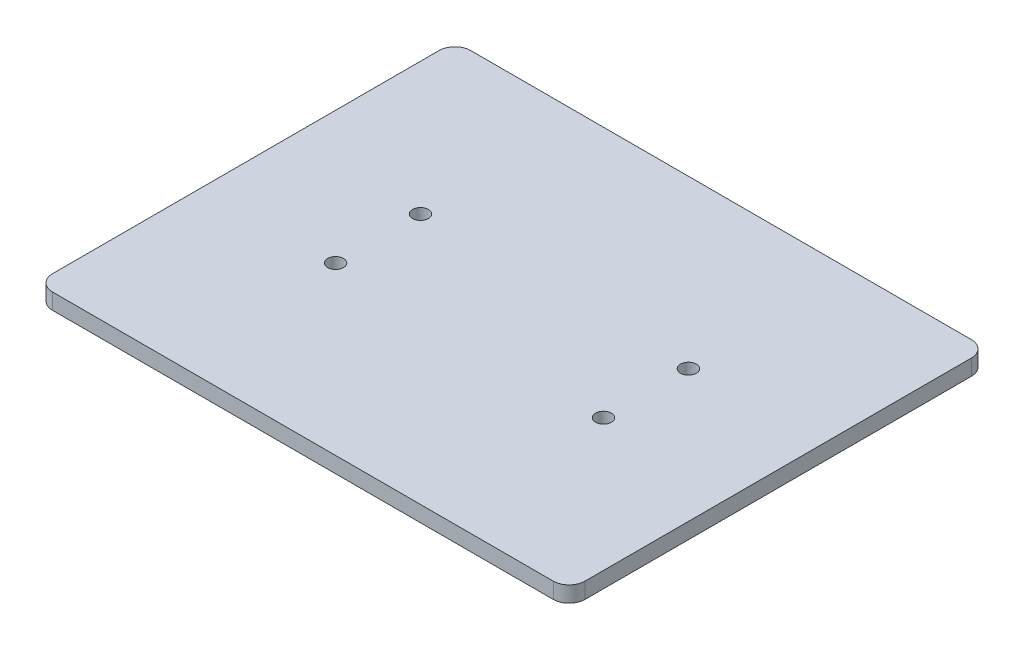
ISO-10303-21;
HEADER;
FILE_DESCRIPTION(('STEP AP214'),'2;1');
FILE_NAME('part.step','',(''),(''),'','','');
FILE_SCHEMA(('AUTOMOTIVE_DESIGN { 1 0 10303 214 1 1 1 1 }'));
ENDSEC;
DATA;
#1=APPLICATION_CONTEXT('core data for automotive mechanical design processes');
#2=APPLICATION_PROTOCOL_DEFINITION('international standard','automotive_design',2000,#1);
#3=PRODUCT_CONTEXT('',#1,'mechanical');
#4=PRODUCT('Part','Part','',(#3));
#5=PRODUCT_RELATED_PRODUCT_CATEGORY('part','',(#4));
#6=PRODUCT_DEFINITION_FORMATION('','',#4);
#7=PRODUCT_DEFINITION_CONTEXT('part definition',#1,'design');
#8=PRODUCT_DEFINITION('design','',#6,#7);
#9=PRODUCT_DEFINITION_SHAPE('','',#8);
#10=(LENGTH_UNIT() NAMED_UNIT(*) SI_UNIT(.MILLI.,.METRE.));
#11=(NAMED_UNIT(*) PLANE_ANGLE_UNIT() SI_UNIT($,.RADIAN.));
#12=(NAMED_UNIT(*) SI_UNIT($,.STERADIAN.) SOLID_ANGLE_UNIT());
#13=UNCERTAINTY_MEASURE_WITH_UNIT(LENGTH_MEASURE(1.E-05),#10,'distance_accuracy_value','');
#14=(GEOMETRIC_REPRESENTATION_CONTEXT(3) GLOBAL_UNCERTAINTY_ASSIGNED_CONTEXT((#13)) GLOBAL_UNIT_ASSIGNED_CONTEXT((#10,
#11,#12)) REPRESENTATION_CONTEXT('',''));
#15=CARTESIAN_POINT('',(0.,0.,0.));
#16=DIRECTION('',(0.,0.,1.));
#17=DIRECTION('',(1.,0.,0.));
#18=AXIS2_PLACEMENT_3D('',#15,#16,#17);
#19=CARTESIAN_POINT('',(0.,5.,0.));
#20=DIRECTION('',(0.,-1.,0.));
#21=DIRECTION('',(0.,0.,-1.));
#22=AXIS2_PLACEMENT_3D('',#19,#20,#21);
#23=PLANE('',#22);
#24=CARTESIAN_POINT('',(41.675,5.,-79.25));
#25=DIRECTION('',(0.,-1.,0.));
#26=DIRECTION('',(0.,0.,-1.));
#27=AXIS2_PLACEMENT_3D('',#24,#25,#26);
#28=CIRCLE('',#27,2.5);
#29=CARTESIAN_POINT('',(41.675,5.,-81.75));
#30=VERTEX_POINT('',#29);
#31=EDGE_CURVE('E162',#30,#30,#28,.T.);
#32=ORIENTED_EDGE('',*,*,#31,.T.);
#33=EDGE_LOOP('',(#32));
#34=FACE_BOUND('',#33,.T.);
#35=DIRECTION('',(1.,0.,0.));
#36=VECTOR('',#35,1.);
#37=CARTESIAN_POINT('',(0.,5.,0.));
#38=LINE('',#37,#36);
#39=CARTESIAN_POINT('',(5.,5.,0.));
#40=VERTEX_POINT('',#39);
#41=CARTESIAN_POINT('',(162.75,5.,0.));
#42=VERTEX_POINT('',#41);
#43=EDGE_CURVE('E185',#40,#42,#38,.T.);
#44=ORIENTED_EDGE('',*,*,#43,.T.);
#45=CARTESIAN_POINT('',(162.75,5.,-5.00000000000003));
#46=DIRECTION('',(0.,-1.,0.));
#47=DIRECTION('',(0.,0.,-1.));
#48=AXIS2_PLACEMENT_3D('',#45,#46,#47);
#49=CIRCLE('',#48,5.);
#50=CARTESIAN_POINT('',(167.75,5.,-5.00000000000003));
#51=VERTEX_POINT('',#50);
#52=EDGE_CURVE('E44',#42,#51,#49,.F.);
#53=ORIENTED_EDGE('',*,*,#52,.T.);
#54=DIRECTION('',(0.,0.,-1.));
#55=VECTOR('',#54,1.);
#56=CARTESIAN_POINT('',(167.75,5.,-131.75));
#57=LINE('',#56,#55);
#58=CARTESIAN_POINT('',(167.75,5.,-126.75));
#59=VERTEX_POINT('',#58);
#60=EDGE_CURVE('E128',#51,#59,#57,.T.);
#61=ORIENTED_EDGE('',*,*,#60,.T.);
#62=CARTESIAN_POINT('',(162.75,5.,-126.75));
#63=DIRECTION('',(0.,-1.,0.));
#64=DIRECTION('',(0.,0.,-1.));
#65=AXIS2_PLACEMENT_3D('',#62,#63,#64);
#66=CIRCLE('',#65,5.);
#67=CARTESIAN_POINT('',(162.75,5.,-131.75));
#68=VERTEX_POINT('',#67);
#69=EDGE_CURVE('E152',#59,#68,#66,.F.);
#70=ORIENTED_EDGE('',*,*,#69,.T.);
#71=DIRECTION('',(-1.,0.,0.));
#72=VECTOR('',#71,1.);
#73=CARTESIAN_POINT('',(0.,5.,-131.75));
#74=LINE('',#73,#72);
#75=CARTESIAN_POINT('',(5.,5.,-131.75));
#76=VERTEX_POINT('',#75);
#77=EDGE_CURVE('E125',#68,#76,#74,.T.);
#78=ORIENTED_EDGE('',*,*,#77,.T.);
#79=CARTESIAN_POINT('',(5.,5.,-126.75));
#80=DIRECTION('',(0.,-1.,0.));
#81=DIRECTION('',(0.,0.,-1.));
#82=AXIS2_PLACEMENT_3D('',#79,#80,#81);
#83=CIRCLE('',#82,5.);
#84=CARTESIAN_POINT('',(0.,5.,-126.75));
#85=VERTEX_POINT('',#84);
#86=EDGE_CURVE('E141',#76,#85,#83,.F.);
#87=ORIENTED_EDGE('',*,*,#86,.T.);
#88=DIRECTION('',(0.,0.,1.));
#89=VECTOR('',#88,1.);
#90=CARTESIAN_POINT('',(0.,5.,0.));
#91=LINE('',#90,#89);
#92=CARTESIAN_POINT('',(0.,5.,-5.));
#93=VERTEX_POINT('',#92);
#94=EDGE_CURVE('E183',#85,#93,#91,.T.);
#95=ORIENTED_EDGE('',*,*,#94,.T.);
#96=CARTESIAN_POINT('',(5.,5.,-5.));
#97=DIRECTION('',(0.,-1.,0.));
#98=DIRECTION('',(0.,0.,-1.));
#99=AXIS2_PLACEMENT_3D('',#96,#97,#98);
#100=CIRCLE('',#99,5.);
#101=EDGE_CURVE('E120',#93,#40,#100,.F.);
#102=ORIENTED_EDGE('',*,*,#101,.T.);
#103=EDGE_LOOP('',(#44,#53,#61,#70,#78,#87,#95,#102));
#104=FACE_BOUND('',#103,.T.);
#105=CARTESIAN_POINT('',(41.675,5.,-52.5));
#106=DIRECTION('',(0.,1.,0.));
#107=DIRECTION('',(0.,0.,1.));
#108=AXIS2_PLACEMENT_3D('',#105,#106,#107);
#109=CIRCLE('',#108,2.50000000000002);
#110=CARTESIAN_POINT('',(41.675,5.,-50.));
#111=VERTEX_POINT('',#110);
#112=EDGE_CURVE('E165',#111,#111,#109,.T.);
#113=ORIENTED_EDGE('',*,*,#112,.F.);
#114=EDGE_LOOP('',(#113));
#115=FACE_BOUND('',#114,.T.);
#116=CARTESIAN_POINT('',(126.075,5.,-79.25));
#117=DIRECTION('',(0.,1.,0.));
#118=DIRECTION('',(0.,0.,1.));
#119=AXIS2_PLACEMENT_3D('',#116,#117,#118);
#120=CIRCLE('',#119,2.5);
#121=CARTESIAN_POINT('',(126.075,5.,-76.75));
#122=VERTEX_POINT('',#121);
#123=EDGE_CURVE('E168',#122,#122,#120,.T.);
#124=ORIENTED_EDGE('',*,*,#123,.F.);
#125=EDGE_LOOP('',(#124));
#126=FACE_BOUND('',#125,.T.);
#127=CARTESIAN_POINT('',(126.075,5.,-52.5));
#128=DIRECTION('',(0.,-1.,0.));
#129=DIRECTION('',(0.,0.,-1.));
#130=AXIS2_PLACEMENT_3D('',#127,#128,#129);
#131=CIRCLE('',#130,2.50000000000002);
#132=CARTESIAN_POINT('',(126.075,5.,-55.));
#133=VERTEX_POINT('',#132);
#134=EDGE_CURVE('E178',#133,#133,#131,.T.);
#135=ORIENTED_EDGE('',*,*,#134,.T.);
#136=EDGE_LOOP('',(#135));
#137=FACE_BOUND('',#136,.T.);
#138=ADVANCED_FACE('F35',(#34,#104,#115,#126,#137),#23,.F.);
#139=CARTESIAN_POINT('',(0.,0.,0.));
#140=DIRECTION('',(0.,-1.,0.));
#141=DIRECTION('',(0.,0.,-1.));
#142=AXIS2_PLACEMENT_3D('',#139,#140,#141);
#143=PLANE('',#142);
#144=CARTESIAN_POINT('',(41.675,0.,-79.25));
#145=DIRECTION('',(0.,-1.,0.));
#146=DIRECTION('',(0.,0.,-1.));
#147=AXIS2_PLACEMENT_3D('',#144,#145,#146);
#148=CIRCLE('',#147,2.5);
#149=CARTESIAN_POINT('',(41.675,0.,-81.75));
#150=VERTEX_POINT('',#149);
#151=EDGE_CURVE('E111',#150,#150,#148,.F.);
#152=ORIENTED_EDGE('',*,*,#151,.T.);
#153=EDGE_LOOP('',(#152));
#154=FACE_BOUND('',#153,.T.);
#155=DIRECTION('',(0.,0.,-1.));
#156=VECTOR('',#155,1.);
#157=CARTESIAN_POINT('',(167.75,0.,-131.75));
#158=LINE('',#157,#156);
#159=CARTESIAN_POINT('',(167.75,0.,-5.00000000000003));
#160=VERTEX_POINT('',#159);
#161=CARTESIAN_POINT('',(167.75,0.,-126.75));
#162=VERTEX_POINT('',#161);
#163=EDGE_CURVE('E189',#160,#162,#158,.T.);
#164=ORIENTED_EDGE('',*,*,#163,.F.);
#165=CARTESIAN_POINT('',(162.75,0.,-5.00000000000003));
#166=DIRECTION('',(0.,-1.,0.));
#167=DIRECTION('',(0.,0.,-1.));
#168=AXIS2_PLACEMENT_3D('',#165,#166,#167);
#169=CIRCLE('',#168,5.);
#170=CARTESIAN_POINT('',(162.75,0.,0.));
#171=VERTEX_POINT('',#170);
#172=EDGE_CURVE('E11',#160,#171,#169,.T.);
#173=ORIENTED_EDGE('',*,*,#172,.T.);
#174=DIRECTION('',(1.,0.,0.));
#175=VECTOR('',#174,1.);
#176=CARTESIAN_POINT('',(0.,0.,0.));
#177=LINE('',#176,#175);
#178=CARTESIAN_POINT('',(5.,0.,0.));
#179=VERTEX_POINT('',#178);
#180=EDGE_CURVE('E110',#179,#171,#177,.T.);
#181=ORIENTED_EDGE('',*,*,#180,.F.);
#182=CARTESIAN_POINT('',(5.,0.,-5.));
#183=DIRECTION('',(0.,-1.,0.));
#184=DIRECTION('',(0.,0.,-1.));
#185=AXIS2_PLACEMENT_3D('',#182,#183,#184);
#186=CIRCLE('',#185,5.);
#187=CARTESIAN_POINT('',(0.,0.,-5.));
#188=VERTEX_POINT('',#187);
#189=EDGE_CURVE('E113',#179,#188,#186,.T.);
#190=ORIENTED_EDGE('',*,*,#189,.T.);
#191=DIRECTION('',(0.,0.,1.));
#192=VECTOR('',#191,1.);
#193=CARTESIAN_POINT('',(0.,0.,0.));
#194=LINE('',#193,#192);
#195=CARTESIAN_POINT('',(0.,0.,-126.75));
#196=VERTEX_POINT('',#195);
#197=EDGE_CURVE('E101',#196,#188,#194,.T.);
#198=ORIENTED_EDGE('',*,*,#197,.F.);
#199=CARTESIAN_POINT('',(5.,0.,-126.75));
#200=DIRECTION('',(0.,-1.,0.));
#201=DIRECTION('',(0.,0.,-1.));
#202=AXIS2_PLACEMENT_3D('',#199,#200,#201);
#203=CIRCLE('',#202,5.);
#204=CARTESIAN_POINT('',(5.,0.,-131.75));
#205=VERTEX_POINT('',#204);
#206=EDGE_CURVE('E139',#196,#205,#203,.T.);
#207=ORIENTED_EDGE('',*,*,#206,.T.);
#208=DIRECTION('',(-1.,0.,0.));
#209=VECTOR('',#208,1.);
#210=CARTESIAN_POINT('',(0.,0.,-131.75));
#211=LINE('',#210,#209);
#212=CARTESIAN_POINT('',(162.75,0.,-131.75));
#213=VERTEX_POINT('',#212);
#214=EDGE_CURVE('E131',#213,#205,#211,.T.);
#215=ORIENTED_EDGE('',*,*,#214,.F.);
#216=CARTESIAN_POINT('',(162.75,0.,-126.75));
#217=DIRECTION('',(0.,-1.,0.));
#218=DIRECTION('',(0.,0.,-1.));
#219=AXIS2_PLACEMENT_3D('',#216,#217,#218);
#220=CIRCLE('',#219,5.);
#221=EDGE_CURVE('E149',#213,#162,#220,.T.);
#222=ORIENTED_EDGE('',*,*,#221,.T.);
#223=EDGE_LOOP('',(#164,#173,#181,#190,#198,#207,#215,#222));
#224=FACE_BOUND('',#223,.T.);
#225=CARTESIAN_POINT('',(41.675,0.,-52.5));
#226=DIRECTION('',(0.,-1.,0.));
#227=DIRECTION('',(0.,0.,-1.));
#228=AXIS2_PLACEMENT_3D('',#225,#226,#227);
#229=CIRCLE('',#228,2.50000000000002);
#230=CARTESIAN_POINT('',(41.675,0.,-55.));
#231=VERTEX_POINT('',#230);
#232=EDGE_CURVE('E163',#231,#231,#229,.T.);
#233=ORIENTED_EDGE('',*,*,#232,.F.);
#234=EDGE_LOOP('',(#233));
#235=FACE_BOUND('',#234,.T.);
#236=CARTESIAN_POINT('',(126.075,0.,-79.25));
#237=DIRECTION('',(0.,-1.,0.));
#238=DIRECTION('',(0.,0.,-1.));
#239=AXIS2_PLACEMENT_3D('',#236,#237,#238);
#240=CIRCLE('',#239,2.5);
#241=CARTESIAN_POINT('',(126.075,0.,-81.75));
#242=VERTEX_POINT('',#241);
#243=EDGE_CURVE('E166',#242,#242,#240,.T.);
#244=ORIENTED_EDGE('',*,*,#243,.F.);
#245=EDGE_LOOP('',(#244));
#246=FACE_BOUND('',#245,.T.);
#247=CARTESIAN_POINT('',(126.075,0.,-52.5));
#248=DIRECTION('',(0.,-1.,0.));
#249=DIRECTION('',(0.,0.,-1.));
#250=AXIS2_PLACEMENT_3D('',#247,#248,#249);
#251=CIRCLE('',#250,2.50000000000002);
#252=CARTESIAN_POINT('',(126.075,0.,-55.));
#253=VERTEX_POINT('',#252);
#254=EDGE_CURVE('E39',#253,#253,#251,.F.);
#255=ORIENTED_EDGE('',*,*,#254,.T.);
#256=EDGE_LOOP('',(#255));
#257=FACE_BOUND('',#256,.T.);
#258=ADVANCED_FACE('F114',(#154,#224,#235,#246,#257),#143,.T.);
#259=CARTESIAN_POINT('',(162.75,5.,-5.00000000000003));
#260=DIRECTION('',(0.,-1.,0.));
#261=DIRECTION('',(0.,0.,-1.));
#262=AXIS2_PLACEMENT_3D('',#259,#260,#261);
#263=CYLINDRICAL_SURFACE('',#262,5.);
#264=DIRECTION('',(0.,-1.,0.));
#265=VECTOR('',#264,1.);
#266=CARTESIAN_POINT('',(167.75,5.,-5.00000000000003));
#267=LINE('',#266,#265);
#268=EDGE_CURVE('E154',#51,#160,#267,.T.);
#269=ORIENTED_EDGE('',*,*,#268,.F.);
#270=ORIENTED_EDGE('',*,*,#52,.F.);
#271=DIRECTION('',(0.,-1.,0.));
#272=VECTOR('',#271,1.);
#273=CARTESIAN_POINT('',(162.75,5.,0.));
#274=LINE('',#273,#272);
#275=EDGE_CURVE('E157',#171,#42,#274,.F.);
#276=ORIENTED_EDGE('',*,*,#275,.F.);
#277=ORIENTED_EDGE('',*,*,#172,.F.);
#278=EDGE_LOOP('',(#269,#270,#276,#277));
#279=FACE_BOUND('',#278,.T.);
#280=ADVANCED_FACE('F37',(#279),#263,.T.);
#281=CARTESIAN_POINT('',(162.75,5.,-126.75));
#282=DIRECTION('',(0.,1.,0.));
#283=DIRECTION('',(0.,0.,1.));
#284=AXIS2_PLACEMENT_3D('',#281,#282,#283);
#285=CYLINDRICAL_SURFACE('',#284,5.);
#286=DIRECTION('',(0.,1.,0.));
#287=VECTOR('',#286,1.);
#288=CARTESIAN_POINT('',(167.75,5.,-126.75));
#289=LINE('',#288,#287);
#290=EDGE_CURVE('E143',#162,#59,#289,.T.);
#291=ORIENTED_EDGE('',*,*,#290,.F.);
#292=ORIENTED_EDGE('',*,*,#221,.F.);
#293=DIRECTION('',(0.,1.,0.));
#294=VECTOR('',#293,1.);
#295=CARTESIAN_POINT('',(162.75,5.,-131.75));
#296=LINE('',#295,#294);
#297=EDGE_CURVE('E146',#68,#213,#296,.F.);
#298=ORIENTED_EDGE('',*,*,#297,.F.);
#299=ORIENTED_EDGE('',*,*,#69,.F.);
#300=EDGE_LOOP('',(#291,#292,#298,#299));
#301=FACE_BOUND('',#300,.T.);
#302=ADVANCED_FACE('F206',(#301),#285,.T.);
#303=CARTESIAN_POINT('',(5.,5.,-126.75));
#304=DIRECTION('',(0.,1.,0.));
#305=DIRECTION('',(0.,0.,1.));
#306=AXIS2_PLACEMENT_3D('',#303,#304,#305);
#307=CYLINDRICAL_SURFACE('',#306,5.);
#308=DIRECTION('',(0.,1.,0.));
#309=VECTOR('',#308,1.);
#310=CARTESIAN_POINT('',(5.,5.,-131.75));
#311=LINE('',#310,#309);
#312=EDGE_CURVE('E135',#205,#76,#311,.T.);
#313=ORIENTED_EDGE('',*,*,#312,.F.);
#314=ORIENTED_EDGE('',*,*,#206,.F.);
#315=DIRECTION('',(0.,1.,0.));
#316=VECTOR('',#315,1.);
#317=CARTESIAN_POINT('',(0.,5.,-126.75));
#318=LINE('',#317,#316);
#319=EDGE_CURVE('E108',#85,#196,#318,.F.);
#320=ORIENTED_EDGE('',*,*,#319,.F.);
#321=ORIENTED_EDGE('',*,*,#86,.F.);
#322=EDGE_LOOP('',(#313,#314,#320,#321));
#323=FACE_BOUND('',#322,.T.);
#324=ADVANCED_FACE('F199',(#323),#307,.T.);
#325=CARTESIAN_POINT('',(5.,5.,-5.));
#326=DIRECTION('',(0.,1.,0.));
#327=DIRECTION('',(0.,0.,1.));
#328=AXIS2_PLACEMENT_3D('',#325,#326,#327);
#329=CYLINDRICAL_SURFACE('',#328,5.);
#330=DIRECTION('',(0.,1.,0.));
#331=VECTOR('',#330,1.);
#332=CARTESIAN_POINT('',(0.,5.,-5.));
#333=LINE('',#332,#331);
#334=EDGE_CURVE('E106',#188,#93,#333,.T.);
#335=ORIENTED_EDGE('',*,*,#334,.F.);
#336=ORIENTED_EDGE('',*,*,#189,.F.);
#337=DIRECTION('',(0.,1.,0.));
#338=VECTOR('',#337,1.);
#339=CARTESIAN_POINT('',(5.,5.,0.));
#340=LINE('',#339,#338);
#341=EDGE_CURVE('E121',#40,#179,#340,.F.);
#342=ORIENTED_EDGE('',*,*,#341,.F.);
#343=ORIENTED_EDGE('',*,*,#101,.F.);
#344=EDGE_LOOP('',(#335,#336,#342,#343));
#345=FACE_BOUND('',#344,.T.);
#346=ADVANCED_FACE('F124',(#345),#329,.T.);
#347=CARTESIAN_POINT('',(0.,5.,0.));
#348=DIRECTION('',(1.,0.,0.));
#349=DIRECTION('',(0.,0.,-1.));
#350=AXIS2_PLACEMENT_3D('',#347,#348,#349);
#351=PLANE('',#350);
#352=ORIENTED_EDGE('',*,*,#94,.F.);
#353=ORIENTED_EDGE('',*,*,#319,.T.);
#354=ORIENTED_EDGE('',*,*,#197,.T.);
#355=ORIENTED_EDGE('',*,*,#334,.T.);
#356=EDGE_LOOP('',(#352,#353,#354,#355));
#357=FACE_BOUND('',#356,.T.);
#358=ADVANCED_FACE('F104',(#357),#351,.F.);
#359=CARTESIAN_POINT('',(0.,5.,0.));
#360=DIRECTION('',(0.,0.,-1.));
#361=DIRECTION('',(-1.,0.,0.));
#362=AXIS2_PLACEMENT_3D('',#359,#360,#361);
#363=PLANE('',#362);
#364=ORIENTED_EDGE('',*,*,#180,.T.);
#365=ORIENTED_EDGE('',*,*,#275,.T.);
#366=ORIENTED_EDGE('',*,*,#43,.F.);
#367=ORIENTED_EDGE('',*,*,#341,.T.);
#368=EDGE_LOOP('',(#364,#365,#366,#367));
#369=FACE_BOUND('',#368,.T.);
#370=ADVANCED_FACE('F210',(#369),#363,.F.);
#371=CARTESIAN_POINT('',(167.75,5.,-131.75));
#372=DIRECTION('',(-1.,0.,0.));
#373=DIRECTION('',(0.,0.,1.));
#374=AXIS2_PLACEMENT_3D('',#371,#372,#373);
#375=PLANE('',#374);
#376=ORIENTED_EDGE('',*,*,#60,.F.);
#377=ORIENTED_EDGE('',*,*,#268,.T.);
#378=ORIENTED_EDGE('',*,*,#163,.T.);
#379=ORIENTED_EDGE('',*,*,#290,.T.);
#380=EDGE_LOOP('',(#376,#377,#378,#379));
#381=FACE_BOUND('',#380,.T.);
#382=ADVANCED_FACE('F207',(#381),#375,.F.);
#383=CARTESIAN_POINT('',(0.,5.,-131.75));
#384=DIRECTION('',(0.,0.,1.));
#385=DIRECTION('',(1.,0.,0.));
#386=AXIS2_PLACEMENT_3D('',#383,#384,#385);
#387=PLANE('',#386);
#388=ORIENTED_EDGE('',*,*,#77,.F.);
#389=ORIENTED_EDGE('',*,*,#297,.T.);
#390=ORIENTED_EDGE('',*,*,#214,.T.);
#391=ORIENTED_EDGE('',*,*,#312,.T.);
#392=EDGE_LOOP('',(#388,#389,#390,#391));
#393=FACE_BOUND('',#392,.T.);
#394=ADVANCED_FACE('F194',(#393),#387,.F.);
#395=CARTESIAN_POINT('',(41.675,-5.,-79.25));
#396=DIRECTION('',(0.,1.,0.));
#397=DIRECTION('',(0.,0.,1.));
#398=AXIS2_PLACEMENT_3D('',#395,#396,#397);
#399=CYLINDRICAL_SURFACE('',#398,2.5);
#400=ORIENTED_EDGE('',*,*,#151,.F.);
#401=EDGE_LOOP('',(#400));
#402=FACE_BOUND('',#401,.T.);
#403=ORIENTED_EDGE('',*,*,#31,.F.);
#404=EDGE_LOOP('',(#403));
#405=FACE_BOUND('',#404,.T.);
#406=ADVANCED_FACE('F229',(#402,#405),#399,.F.);
#407=CARTESIAN_POINT('',(41.675,-5.,-52.5));
#408=DIRECTION('',(0.,1.,0.));
#409=DIRECTION('',(0.,0.,1.));
#410=AXIS2_PLACEMENT_3D('',#407,#408,#409);
#411=CYLINDRICAL_SURFACE('',#410,2.50000000000002);
#412=ORIENTED_EDGE('',*,*,#232,.T.);
#413=EDGE_LOOP('',(#412));
#414=FACE_BOUND('',#413,.T.);
#415=ORIENTED_EDGE('',*,*,#112,.T.);
#416=EDGE_LOOP('',(#415));
#417=FACE_BOUND('',#416,.T.);
#418=ADVANCED_FACE('F237',(#414,#417),#411,.F.);
#419=CARTESIAN_POINT('',(126.075,-5.,-79.25));
#420=DIRECTION('',(0.,1.,0.));
#421=DIRECTION('',(0.,0.,1.));
#422=AXIS2_PLACEMENT_3D('',#419,#420,#421);
#423=CYLINDRICAL_SURFACE('',#422,2.5);
#424=ORIENTED_EDGE('',*,*,#243,.T.);
#425=EDGE_LOOP('',(#424));
#426=FACE_BOUND('',#425,.T.);
#427=ORIENTED_EDGE('',*,*,#123,.T.);
#428=EDGE_LOOP('',(#427));
#429=FACE_BOUND('',#428,.T.);
#430=ADVANCED_FACE('F242',(#426,#429),#423,.F.);
#431=CARTESIAN_POINT('',(126.075,-5.,-52.5));
#432=DIRECTION('',(0.,1.,0.));
#433=DIRECTION('',(0.,0.,1.));
#434=AXIS2_PLACEMENT_3D('',#431,#432,#433);
#435=CYLINDRICAL_SURFACE('',#434,2.50000000000002);
#436=ORIENTED_EDGE('',*,*,#254,.F.);
#437=EDGE_LOOP('',(#436));
#438=FACE_BOUND('',#437,.T.);
#439=ORIENTED_EDGE('',*,*,#134,.F.);
#440=EDGE_LOOP('',(#439));
#441=FACE_BOUND('',#440,.T.);
#442=ADVANCED_FACE('F250',(#438,#441),#435,.F.);
#443=CLOSED_SHELL('',(#138,#258,#280,#302,#324,#346,#358,#370,#382,#394,#406,#418,#430,#442));
#444=MANIFOLD_SOLID_BREP('B2',#443);
#445=ADVANCED_BREP_SHAPE_REPRESENTATION('',(#18,#444),#14);
#446=SHAPE_DEFINITION_REPRESENTATION(#9,#445);
ENDSEC;
END-ISO-10303-21;
